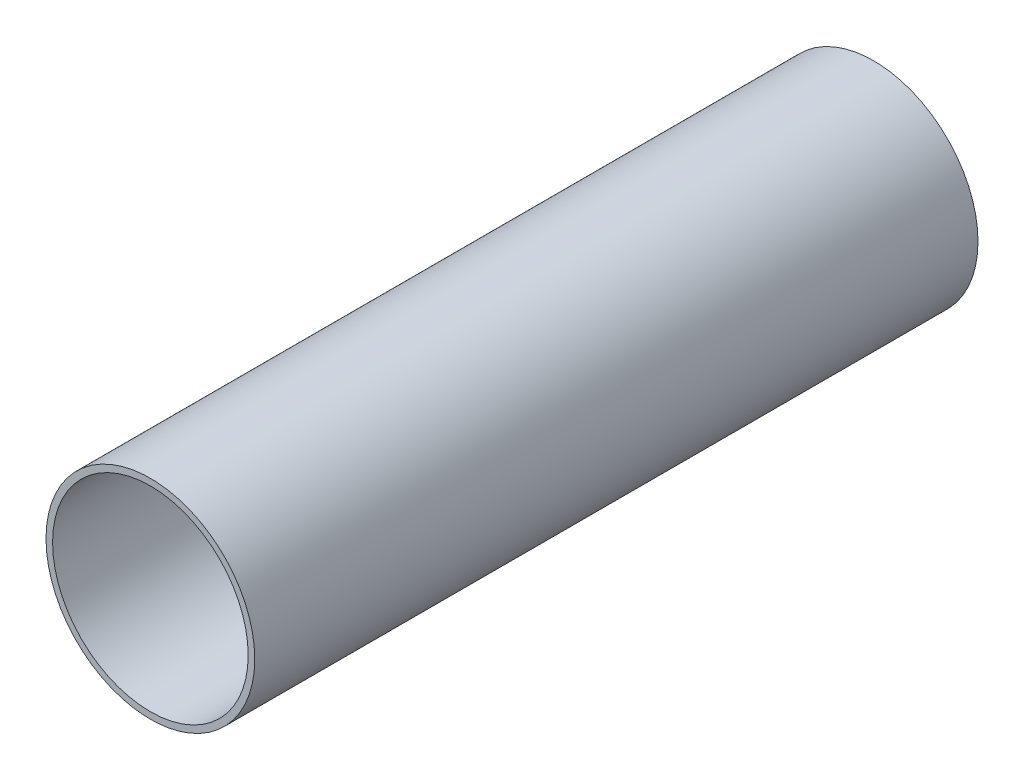
ISO-10303-21;
HEADER;
FILE_DESCRIPTION(('STEP AP214'),'2;1');
FILE_NAME('part.step','',(''),(''),'','','');
FILE_SCHEMA(('AUTOMOTIVE_DESIGN { 1 0 10303 214 1 1 1 1 }'));
ENDSEC;
DATA;
#1=APPLICATION_CONTEXT('core data for automotive mechanical design processes');
#2=APPLICATION_PROTOCOL_DEFINITION('international standard','automotive_design',2000,#1);
#3=PRODUCT_CONTEXT('',#1,'mechanical');
#4=PRODUCT('Part','Part','',(#3));
#5=PRODUCT_RELATED_PRODUCT_CATEGORY('part','',(#4));
#6=PRODUCT_DEFINITION_FORMATION('','',#4);
#7=PRODUCT_DEFINITION_CONTEXT('part definition',#1,'design');
#8=PRODUCT_DEFINITION('design','',#6,#7);
#9=PRODUCT_DEFINITION_SHAPE('','',#8);
#10=(LENGTH_UNIT() NAMED_UNIT(*) SI_UNIT(.MILLI.,.METRE.));
#11=(NAMED_UNIT(*) PLANE_ANGLE_UNIT() SI_UNIT($,.RADIAN.));
#12=(NAMED_UNIT(*) SI_UNIT($,.STERADIAN.) SOLID_ANGLE_UNIT());
#13=UNCERTAINTY_MEASURE_WITH_UNIT(LENGTH_MEASURE(1.E-05),#10,'distance_accuracy_value','');
#14=(GEOMETRIC_REPRESENTATION_CONTEXT(3) GLOBAL_UNCERTAINTY_ASSIGNED_CONTEXT((#13)) GLOBAL_UNIT_ASSIGNED_CONTEXT((#10,
#11,#12)) REPRESENTATION_CONTEXT('',''));
#15=CARTESIAN_POINT('',(0.,0.,0.));
#16=DIRECTION('',(0.,0.,1.));
#17=DIRECTION('',(1.,0.,0.));
#18=AXIS2_PLACEMENT_3D('',#15,#16,#17);
#19=CARTESIAN_POINT('',(0.,0.,220.));
#20=DIRECTION('',(0.,0.,1.));
#21=DIRECTION('',(1.,0.,0.));
#22=AXIS2_PLACEMENT_3D('',#19,#20,#21);
#23=PLANE('',#22);
#24=CARTESIAN_POINT('',(0.,0.,220.));
#25=DIRECTION('',(0.,0.,1.));
#26=DIRECTION('',(1.,0.,0.));
#27=AXIS2_PLACEMENT_3D('',#24,#25,#26);
#28=CIRCLE('',#27,31.75);
#29=CARTESIAN_POINT('',(31.75,0.,220.));
#30=VERTEX_POINT('',#29);
#31=EDGE_CURVE('E10',#30,#30,#28,.T.);
#32=ORIENTED_EDGE('',*,*,#31,.T.);
#33=EDGE_LOOP('',(#32));
#34=FACE_BOUND('',#33,.T.);
#35=CARTESIAN_POINT('',(0.,0.,220.));
#36=DIRECTION('',(0.,0.,1.));
#37=DIRECTION('',(1.,0.,0.));
#38=AXIS2_PLACEMENT_3D('',#35,#36,#37);
#39=CIRCLE('',#38,29.75);
#40=CARTESIAN_POINT('',(29.75,0.,220.));
#41=VERTEX_POINT('',#40);
#42=EDGE_CURVE('E46',#41,#41,#39,.T.);
#43=ORIENTED_EDGE('',*,*,#42,.F.);
#44=EDGE_LOOP('',(#43));
#45=FACE_BOUND('',#44,.T.);
#46=ADVANCED_FACE('F35',(#34,#45),#23,.T.);
#47=CARTESIAN_POINT('',(0.,0.,0.));
#48=DIRECTION('',(0.,0.,1.));
#49=DIRECTION('',(1.,0.,0.));
#50=AXIS2_PLACEMENT_3D('',#47,#48,#49);
#51=PLANE('',#50);
#52=CARTESIAN_POINT('',(0.,0.,0.));
#53=DIRECTION('',(0.,0.,1.));
#54=DIRECTION('',(1.,0.,0.));
#55=AXIS2_PLACEMENT_3D('',#52,#53,#54);
#56=CIRCLE('',#55,31.75);
#57=CARTESIAN_POINT('',(31.75,0.,0.));
#58=VERTEX_POINT('',#57);
#59=EDGE_CURVE('E39',#58,#58,#56,.T.);
#60=ORIENTED_EDGE('',*,*,#59,.F.);
#61=EDGE_LOOP('',(#60));
#62=FACE_BOUND('',#61,.T.);
#63=CARTESIAN_POINT('',(0.,0.,0.));
#64=DIRECTION('',(0.,0.,1.));
#65=DIRECTION('',(1.,0.,0.));
#66=AXIS2_PLACEMENT_3D('',#63,#64,#65);
#67=CIRCLE('',#66,29.75);
#68=CARTESIAN_POINT('',(29.75,0.,0.));
#69=VERTEX_POINT('',#68);
#70=EDGE_CURVE('E48',#69,#69,#67,.T.);
#71=ORIENTED_EDGE('',*,*,#70,.T.);
#72=EDGE_LOOP('',(#71));
#73=FACE_BOUND('',#72,.T.);
#74=ADVANCED_FACE('F58',(#62,#73),#51,.F.);
#75=CARTESIAN_POINT('',(0.,0.,220.));
#76=DIRECTION('',(0.,0.,-1.));
#77=DIRECTION('',(-1.,0.,0.));
#78=AXIS2_PLACEMENT_3D('',#75,#76,#77);
#79=CYLINDRICAL_SURFACE('',#78,31.75);
#80=ORIENTED_EDGE('',*,*,#31,.F.);
#81=EDGE_LOOP('',(#80));
#82=FACE_BOUND('',#81,.T.);
#83=ORIENTED_EDGE('',*,*,#59,.T.);
#84=EDGE_LOOP('',(#83));
#85=FACE_BOUND('',#84,.T.);
#86=ADVANCED_FACE('F37',(#82,#85),#79,.T.);
#87=CARTESIAN_POINT('',(0.,0.,220.));
#88=DIRECTION('',(0.,0.,-1.));
#89=DIRECTION('',(-1.,0.,0.));
#90=AXIS2_PLACEMENT_3D('',#87,#88,#89);
#91=CYLINDRICAL_SURFACE('',#90,29.75);
#92=ORIENTED_EDGE('',*,*,#42,.T.);
#93=EDGE_LOOP('',(#92));
#94=FACE_BOUND('',#93,.T.);
#95=ORIENTED_EDGE('',*,*,#70,.F.);
#96=EDGE_LOOP('',(#95));
#97=FACE_BOUND('',#96,.T.);
#98=ADVANCED_FACE('F54',(#94,#97),#91,.F.);
#99=CLOSED_SHELL('',(#46,#74,#86,#98));
#100=MANIFOLD_SOLID_BREP('B2',#99);
#101=ADVANCED_BREP_SHAPE_REPRESENTATION('',(#18,#100),#14);
#102=SHAPE_DEFINITION_REPRESENTATION(#9,#101);
ENDSEC;
END-ISO-10303-21;
